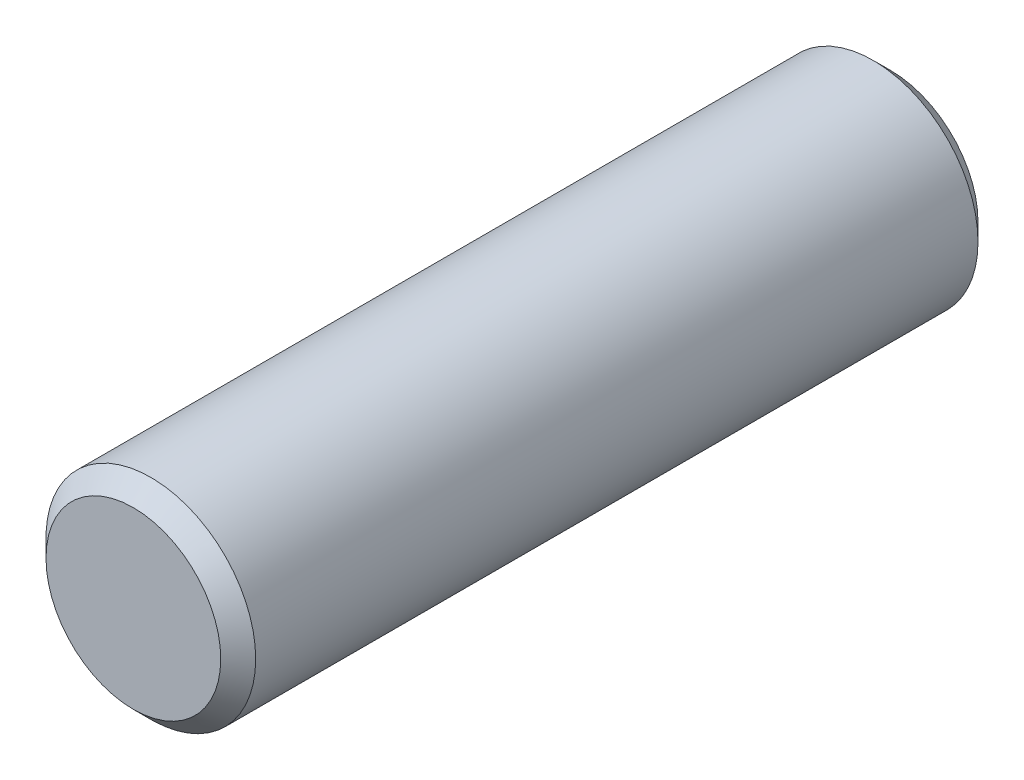
ISO-10303-21;
HEADER;
FILE_DESCRIPTION(('STEP AP214'),'2;1');
FILE_NAME('part.step','',(''),(''),'','','');
FILE_SCHEMA(('AUTOMOTIVE_DESIGN { 1 0 10303 214 1 1 1 1 }'));
ENDSEC;
DATA;
#1=APPLICATION_CONTEXT('core data for automotive mechanical design processes');
#2=APPLICATION_PROTOCOL_DEFINITION('international standard','automotive_design',2000,#1);
#3=PRODUCT_CONTEXT('',#1,'mechanical');
#4=PRODUCT('Part','Part','',(#3));
#5=PRODUCT_RELATED_PRODUCT_CATEGORY('part','',(#4));
#6=PRODUCT_DEFINITION_FORMATION('','',#4);
#7=PRODUCT_DEFINITION_CONTEXT('part definition',#1,'design');
#8=PRODUCT_DEFINITION('design','',#6,#7);
#9=PRODUCT_DEFINITION_SHAPE('','',#8);
#10=(LENGTH_UNIT() NAMED_UNIT(*) SI_UNIT(.MILLI.,.METRE.));
#11=(NAMED_UNIT(*) PLANE_ANGLE_UNIT() SI_UNIT($,.RADIAN.));
#12=(NAMED_UNIT(*) SI_UNIT($,.STERADIAN.) SOLID_ANGLE_UNIT());
#13=UNCERTAINTY_MEASURE_WITH_UNIT(LENGTH_MEASURE(1.E-05),#10,'distance_accuracy_value','');
#14=(GEOMETRIC_REPRESENTATION_CONTEXT(3) GLOBAL_UNCERTAINTY_ASSIGNED_CONTEXT((#13)) GLOBAL_UNIT_ASSIGNED_CONTEXT((#10,
#11,#12)) REPRESENTATION_CONTEXT('',''));
#15=CARTESIAN_POINT('',(0.,0.,0.));
#16=DIRECTION('',(0.,0.,1.));
#17=DIRECTION('',(1.,0.,0.));
#18=AXIS2_PLACEMENT_3D('',#15,#16,#17);
#19=CARTESIAN_POINT('',(0.,0.,32.5));
#20=DIRECTION('',(0.,0.,-1.));
#21=DIRECTION('',(-1.,0.,0.));
#22=AXIS2_PLACEMENT_3D('',#19,#20,#21);
#23=CYLINDRICAL_SURFACE('',#22,9.);
#24=CARTESIAN_POINT('',(0.,0.,-31.));
#25=DIRECTION('',(0.,0.,1.));
#26=DIRECTION('',(1.,0.,0.));
#27=AXIS2_PLACEMENT_3D('',#24,#25,#26);
#28=CIRCLE('',#27,9.);
#29=CARTESIAN_POINT('',(9.,0.,-31.));
#30=VERTEX_POINT('',#29);
#31=EDGE_CURVE('E45',#30,#30,#28,.T.);
#32=ORIENTED_EDGE('',*,*,#31,.T.);
#33=EDGE_LOOP('',(#32));
#34=FACE_BOUND('',#33,.T.);
#35=CARTESIAN_POINT('',(0.,0.,31.));
#36=DIRECTION('',(0.,0.,1.));
#37=DIRECTION('',(1.,0.,0.));
#38=AXIS2_PLACEMENT_3D('',#35,#36,#37);
#39=CIRCLE('',#38,9.);
#40=CARTESIAN_POINT('',(9.,0.,31.));
#41=VERTEX_POINT('',#40);
#42=EDGE_CURVE('E49',#41,#41,#39,.F.);
#43=ORIENTED_EDGE('',*,*,#42,.T.);
#44=EDGE_LOOP('',(#43));
#45=FACE_BOUND('',#44,.T.);
#46=ADVANCED_FACE('F33',(#34,#45),#23,.T.);
#47=CARTESIAN_POINT('',(0.,0.,32.5));
#48=DIRECTION('',(0.,0.,1.));
#49=DIRECTION('',(1.,0.,0.));
#50=AXIS2_PLACEMENT_3D('',#47,#48,#49);
#51=PLANE('',#50);
#52=CARTESIAN_POINT('',(0.,0.,32.5));
#53=DIRECTION('',(0.,0.,1.));
#54=DIRECTION('',(1.,0.,0.));
#55=AXIS2_PLACEMENT_3D('',#52,#53,#54);
#56=CIRCLE('',#55,7.50000000000001);
#57=CARTESIAN_POINT('',(7.50000000000001,0.,32.5));
#58=VERTEX_POINT('',#57);
#59=EDGE_CURVE('E10',#58,#58,#56,.T.);
#60=ORIENTED_EDGE('',*,*,#59,.T.);
#61=EDGE_LOOP('',(#60));
#62=FACE_BOUND('',#61,.T.);
#63=ADVANCED_FACE('F65',(#62),#51,.T.);
#64=CARTESIAN_POINT('',(0.,0.,-32.5));
#65=DIRECTION('',(0.,0.,1.));
#66=DIRECTION('',(1.,0.,0.));
#67=AXIS2_PLACEMENT_3D('',#64,#65,#66);
#68=PLANE('',#67);
#69=CARTESIAN_POINT('',(0.,0.,-32.5));
#70=DIRECTION('',(0.,0.,1.));
#71=DIRECTION('',(1.,0.,0.));
#72=AXIS2_PLACEMENT_3D('',#69,#70,#71);
#73=CIRCLE('',#72,7.49999999999999);
#74=CARTESIAN_POINT('',(7.49999999999999,0.,-32.5));
#75=VERTEX_POINT('',#74);
#76=EDGE_CURVE('E41',#75,#75,#73,.F.);
#77=ORIENTED_EDGE('',*,*,#76,.T.);
#78=EDGE_LOOP('',(#77));
#79=FACE_BOUND('',#78,.T.);
#80=ADVANCED_FACE('F62',(#79),#68,.F.);
#81=CARTESIAN_POINT('',(0.,0.,-31.));
#82=DIRECTION('',(0.,0.,1.));
#83=DIRECTION('',(1.,0.,0.));
#84=AXIS2_PLACEMENT_3D('',#81,#82,#83);
#85=CONICAL_SURFACE('',#84,9.,0.785398163397448);
#86=ORIENTED_EDGE('',*,*,#76,.F.);
#87=EDGE_LOOP('',(#86));
#88=FACE_BOUND('',#87,.T.);
#89=ORIENTED_EDGE('',*,*,#31,.F.);
#90=EDGE_LOOP('',(#89));
#91=FACE_BOUND('',#90,.T.);
#92=ADVANCED_FACE('F58',(#88,#91),#85,.T.);
#93=CARTESIAN_POINT('',(0.,0.,32.5));
#94=DIRECTION('',(0.,0.,-1.));
#95=DIRECTION('',(-1.,0.,0.));
#96=AXIS2_PLACEMENT_3D('',#93,#94,#95);
#97=CONICAL_SURFACE('',#96,7.50000000000001,0.785398163397445);
#98=ORIENTED_EDGE('',*,*,#42,.F.);
#99=EDGE_LOOP('',(#98));
#100=FACE_BOUND('',#99,.T.);
#101=ORIENTED_EDGE('',*,*,#59,.F.);
#102=EDGE_LOOP('',(#101));
#103=FACE_BOUND('',#102,.T.);
#104=ADVANCED_FACE('F36',(#100,#103),#97,.T.);
#105=CLOSED_SHELL('',(#46,#63,#80,#92,#104));
#106=MANIFOLD_SOLID_BREP('B2',#105);
#107=ADVANCED_BREP_SHAPE_REPRESENTATION('',(#18,#106),#14);
#108=SHAPE_DEFINITION_REPRESENTATION(#9,#107);
ENDSEC;
END-ISO-10303-21;
